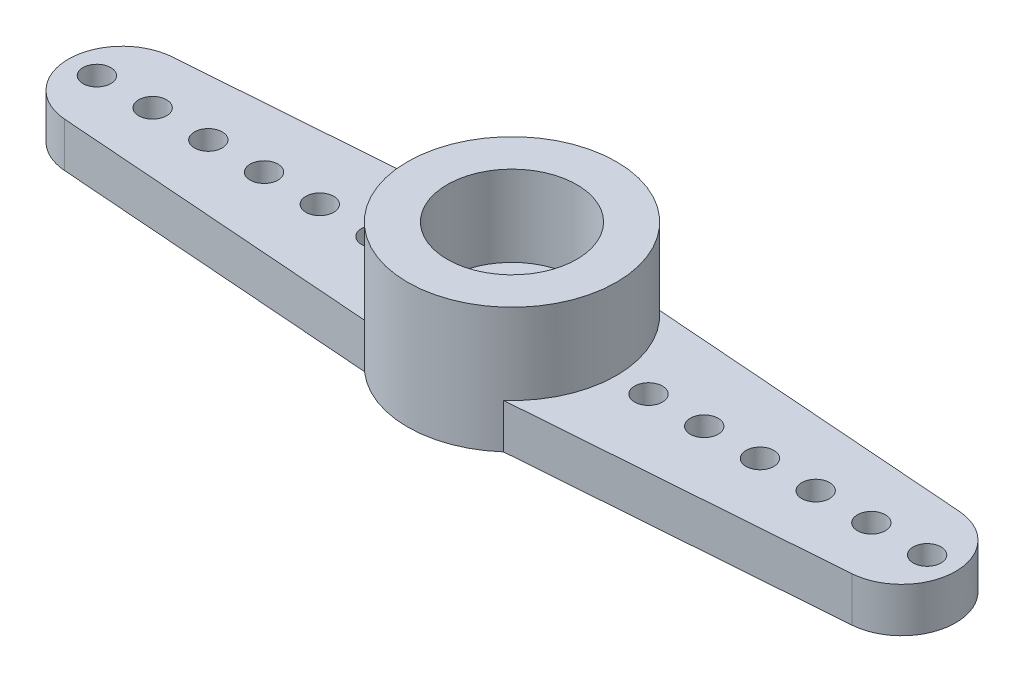
ISO-10303-21;
HEADER;
FILE_DESCRIPTION(('STEP AP214'),'2;1');
FILE_NAME('part.step','',(''),(''),'','','');
FILE_SCHEMA(('AUTOMOTIVE_DESIGN { 1 0 10303 214 1 1 1 1 }'));
ENDSEC;
DATA;
#1=APPLICATION_CONTEXT('core data for automotive mechanical design processes');
#2=APPLICATION_PROTOCOL_DEFINITION('international standard','automotive_design',2000,#1);
#3=PRODUCT_CONTEXT('',#1,'mechanical');
#4=PRODUCT('Part','Part','',(#3));
#5=PRODUCT_RELATED_PRODUCT_CATEGORY('part','',(#4));
#6=PRODUCT_DEFINITION_FORMATION('','',#4);
#7=PRODUCT_DEFINITION_CONTEXT('part definition',#1,'design');
#8=PRODUCT_DEFINITION('design','',#6,#7);
#9=PRODUCT_DEFINITION_SHAPE('','',#8);
#10=(LENGTH_UNIT() NAMED_UNIT(*) SI_UNIT(.MILLI.,.METRE.));
#11=(NAMED_UNIT(*) PLANE_ANGLE_UNIT() SI_UNIT($,.RADIAN.));
#12=(NAMED_UNIT(*) SI_UNIT($,.STERADIAN.) SOLID_ANGLE_UNIT());
#13=UNCERTAINTY_MEASURE_WITH_UNIT(LENGTH_MEASURE(1.E-05),#10,'distance_accuracy_value','');
#14=(GEOMETRIC_REPRESENTATION_CONTEXT(3) GLOBAL_UNCERTAINTY_ASSIGNED_CONTEXT((#13)) GLOBAL_UNIT_ASSIGNED_CONTEXT((#10,
#11,#12)) REPRESENTATION_CONTEXT('',''));
#15=CARTESIAN_POINT('',(0.,0.,0.));
#16=DIRECTION('',(0.,0.,1.));
#17=DIRECTION('',(1.,0.,0.));
#18=AXIS2_PLACEMENT_3D('',#15,#16,#17);
#19=CARTESIAN_POINT('',(0.,1.6,0.));
#20=DIRECTION('',(0.,-1.,0.));
#21=DIRECTION('',(0.,0.,-1.));
#22=AXIS2_PLACEMENT_3D('',#19,#20,#21);
#23=CYLINDRICAL_SURFACE('',#22,1.5);
#24=CARTESIAN_POINT('',(0.,1.6,0.));
#25=DIRECTION('',(0.,1.,0.));
#26=DIRECTION('',(0.,0.,1.));
#27=AXIS2_PLACEMENT_3D('',#24,#25,#26);
#28=CIRCLE('',#27,1.5);
#29=CARTESIAN_POINT('',(0.,1.6,1.5));
#30=VERTEX_POINT('',#29);
#31=EDGE_CURVE('E133',#30,#30,#28,.T.);
#32=ORIENTED_EDGE('',*,*,#31,.T.);
#33=EDGE_LOOP('',(#32));
#34=FACE_BOUND('',#33,.T.);
#35=CARTESIAN_POINT('',(0.,0.8,0.));
#36=DIRECTION('',(0.,-1.,0.));
#37=DIRECTION('',(0.,0.,-1.));
#38=AXIS2_PLACEMENT_3D('',#35,#36,#37);
#39=CIRCLE('',#38,1.5);
#40=CARTESIAN_POINT('',(0.,0.8,-1.5));
#41=VERTEX_POINT('',#40);
#42=EDGE_CURVE('E39',#41,#41,#39,.T.);
#43=ORIENTED_EDGE('',*,*,#42,.T.);
#44=EDGE_LOOP('',(#43));
#45=FACE_BOUND('',#44,.T.);
#46=ADVANCED_FACE('F32',(#34,#45),#23,.F.);
#47=CARTESIAN_POINT('',(14.1314068018781,1.76,-1.93230912585367));
#48=CARTESIAN_POINT('',(14.1314068018781,1.70666666666667,-1.93230912585367));
#49=CARTESIAN_POINT('',(14.1314068018781,1.65333333333333,-1.93230912585367));
#50=CARTESIAN_POINT('',(14.1314068018781,1.06666666666671,-1.93230912585367));
#51=CARTESIAN_POINT('',(14.1314068018781,0.53333333333331,-1.93230912585367));
#52=CARTESIAN_POINT('',(14.1314068018781,-0.0533333333333311,-1.93230912585367));
#53=CARTESIAN_POINT('',(14.1314068018781,-0.106666666666667,-1.93230912585367));
#54=CARTESIAN_POINT('',(14.1314068018781,-0.16,-1.93230912585367));
#55=CARTESIAN_POINT('',(17.4863916285294,1.76,-1.68214916068935));
#56=CARTESIAN_POINT('',(17.4863916285294,1.70666666666667,-1.68214916068935));
#57=CARTESIAN_POINT('',(17.4863916285294,1.65333333333332,-1.68214916068935));
#58=CARTESIAN_POINT('',(17.4863916285294,1.06666666666677,-1.68214916068935));
#59=CARTESIAN_POINT('',(17.4863916285294,0.53333333333331,-1.68214916068935));
#60=CARTESIAN_POINT('',(17.4863916285294,-0.0533333333333311,-1.68214916068935));
#61=CARTESIAN_POINT('',(17.4863916285294,-0.106666666666667,-1.68214916068935));
#62=CARTESIAN_POINT('',(17.4863916285294,-0.16,-1.68214916068935));
#63=CARTESIAN_POINT('',(17.4863916285294,1.76,1.68214916068935));
#64=CARTESIAN_POINT('',(17.4863916285294,1.7066666666667,1.68214916068935));
#65=CARTESIAN_POINT('',(17.4863916285294,1.65333333333329,1.68214916068935));
#66=CARTESIAN_POINT('',(17.4863916285294,1.06666666666706,1.68214916068935));
#67=CARTESIAN_POINT('',(17.4863916285294,0.53333333333331,1.68214916068935));
#68=CARTESIAN_POINT('',(17.4863916285294,-0.0533333333333311,1.68214916068935));
#69=CARTESIAN_POINT('',(17.4863916285294,-0.106666666666667,1.68214916068935));
#70=CARTESIAN_POINT('',(17.4863916285294,-0.16,1.68214916068935));
#71=CARTESIAN_POINT('',(14.1314068018781,1.76,1.93230912585367));
#72=CARTESIAN_POINT('',(14.1314068018781,1.7066666666667,1.93230912585367));
#73=CARTESIAN_POINT('',(14.1314068018781,1.65333333333329,1.93230912585367));
#74=CARTESIAN_POINT('',(14.1314068018781,1.06666666666712,1.93230912585367));
#75=CARTESIAN_POINT('',(14.1314068018781,0.53333333333331,1.93230912585367));
#76=CARTESIAN_POINT('',(14.1314068018781,-0.0533333333333311,1.93230912585367));
#77=CARTESIAN_POINT('',(14.1314068018781,-0.106666666666667,1.93230912585367));
#78=CARTESIAN_POINT('',(14.1314068018781,-0.16,1.93230912585367));
#79=(BOUNDED_SURFACE() B_SPLINE_SURFACE(3,3,((#47,#48,#49,#50,#51,#52,#53,#54),(#55,#56,#57,#58,
#59,#60,#61,#62),(#63,#64,#65,#66,#67,#68,#69,#70),(#71,#72,#73,#74,#75,#76,#77,#78)),
.UNSPECIFIED.,.F.,.F.,.F.) B_SPLINE_SURFACE_WITH_KNOTS((4,4),(4,2,2,4),(0.,1.),(-0.1,0.,1.,1.1),
.UNSPECIFIED.) GEOMETRIC_REPRESENTATION_ITEM() RATIONAL_B_SPLINE_SURFACE(((1.,1.,1.,1.,1.,1.,1.,
1.),(0.382904832106128,0.382904832106128,0.382904832106128,0.382904832106128,0.382904832106128,
0.382904832106128,0.382904832106128,0.382904832106128),(0.382904832106128,0.382904832106128,
0.382904832106128,0.382904832106128,0.382904832106128,0.382904832106128,0.382904832106128,
0.382904832106128),(1.,1.,1.,1.,1.,1.,1.,1.))) REPRESENTATION_ITEM('') SURFACE());
#80=CARTESIAN_POINT('',(14.1314068018781,-0.16,-1.93230912585367));
#81=CARTESIAN_POINT('',(14.1314068018781,-0.106666666666667,-1.93230912585367));
#82=CARTESIAN_POINT('',(14.1314068018781,-0.0533333333333311,-1.93230912585367));
#83=CARTESIAN_POINT('',(14.1314068018781,0.53333333333331,-1.93230912585367));
#84=CARTESIAN_POINT('',(14.1314068018781,1.06666666666671,-1.93230912585367));
#85=CARTESIAN_POINT('',(14.1314068018781,1.65333333333333,-1.93230912585367));
#86=CARTESIAN_POINT('',(14.1314068018781,1.70666666666667,-1.93230912585367));
#87=CARTESIAN_POINT('',(14.1314068018781,1.76,-1.93230912585367));
#88=(BOUNDED_CURVE() B_SPLINE_CURVE(3,(#80,#81,#82,#83,#84,#85,#86,#87),.UNSPECIFIED.,.F.,
.F.) B_SPLINE_CURVE_WITH_KNOTS((4,2,2,4),(-0.1,0.,1.,1.1),
.UNSPECIFIED.) CURVE() GEOMETRIC_REPRESENTATION_ITEM() RATIONAL_B_SPLINE_CURVE((1.,1.,1.,1.,1.,
1.,1.,1.)) REPRESENTATION_ITEM(''));
#89=CARTESIAN_POINT('',(14.1314068018781,1.6,-1.93230912585367));
#90=VERTEX_POINT('',#89);
#91=CARTESIAN_POINT('',(14.1314068018781,0.,-1.93230912585367));
#92=VERTEX_POINT('',#91);
#93=EDGE_CURVE('E272',#90,#92,#88,.F.);
#94=CARTESIAN_POINT('',(14.1314068018781,1.6,-1.93230912585367));
#95=CARTESIAN_POINT('',(17.4863916285294,1.6,-1.68214916068935));
#96=CARTESIAN_POINT('',(17.4863916285294,1.6,1.68214916068935));
#97=CARTESIAN_POINT('',(14.1314068018781,1.6,1.93230912585367));
#98=(BOUNDED_CURVE() B_SPLINE_CURVE(3,(#94,#95,#96,#97),.UNSPECIFIED.,.F.,
.F.) B_SPLINE_CURVE_WITH_KNOTS((4,4),(0.,1.),
.UNSPECIFIED.) CURVE() GEOMETRIC_REPRESENTATION_ITEM() RATIONAL_B_SPLINE_CURVE((1.,
0.382904832106128,0.382904832106128,1.)) REPRESENTATION_ITEM(''));
#99=CARTESIAN_POINT('',(14.1314068018781,1.6,1.93230912585367));
#100=VERTEX_POINT('',#99);
#101=EDGE_CURVE('E44',#100,#90,#98,.F.);
#102=CARTESIAN_POINT('',(14.1314068018781,1.76,1.93230912585367));
#103=CARTESIAN_POINT('',(14.1314068018781,1.7066666666667,1.93230912585367));
#104=CARTESIAN_POINT('',(14.1314068018781,1.65333333333329,1.93230912585367));
#105=CARTESIAN_POINT('',(14.1314068018781,1.06666666666712,1.93230912585367));
#106=CARTESIAN_POINT('',(14.1314068018781,0.53333333333331,1.93230912585367));
#107=CARTESIAN_POINT('',(14.1314068018781,-0.0533333333333311,1.93230912585367));
#108=CARTESIAN_POINT('',(14.1314068018781,-0.106666666666667,1.93230912585367));
#109=CARTESIAN_POINT('',(14.1314068018781,-0.16,1.93230912585367));
#110=(BOUNDED_CURVE() B_SPLINE_CURVE(3,(#102,#103,#104,#105,#106,#107,#108,#109),.UNSPECIFIED.,
.F.,.F.) B_SPLINE_CURVE_WITH_KNOTS((4,2,2,4),(-0.1,0.,1.,1.1),
.UNSPECIFIED.) CURVE() GEOMETRIC_REPRESENTATION_ITEM() RATIONAL_B_SPLINE_CURVE((1.,1.,1.,1.,1.,
1.,1.,1.)) REPRESENTATION_ITEM(''));
#111=CARTESIAN_POINT('',(14.1314068018781,0.,1.93230912585367));
#112=VERTEX_POINT('',#111);
#113=EDGE_CURVE('E106',#112,#100,#110,.F.);
#114=CARTESIAN_POINT('',(14.1314068018781,0.,1.93230912585367));
#115=CARTESIAN_POINT('',(17.4863916285294,0.,1.68214916068935));
#116=CARTESIAN_POINT('',(17.4863916285294,0.,-1.68214916068935));
#117=CARTESIAN_POINT('',(14.1314068018781,0.,-1.93230912585367));
#118=(BOUNDED_CURVE() B_SPLINE_CURVE(3,(#114,#115,#116,#117),.UNSPECIFIED.,.F.,
.F.) B_SPLINE_CURVE_WITH_KNOTS((4,4),(0.,1.),
.UNSPECIFIED.) CURVE() GEOMETRIC_REPRESENTATION_ITEM() RATIONAL_B_SPLINE_CURVE((1.,
0.382904832106128,0.382904832106128,1.)) REPRESENTATION_ITEM(''));
#119=EDGE_CURVE('E11',#92,#112,#118,.F.);
#120=ORIENTED_EDGE('',*,*,#93,.F.);
#121=ORIENTED_EDGE('',*,*,#101,.F.);
#122=ORIENTED_EDGE('',*,*,#113,.F.);
#123=ORIENTED_EDGE('',*,*,#119,.F.);
#124=EDGE_LOOP('',(#120,#121,#122,#123));
#125=FACE_BOUND('',#124,.T.);
#126=ADVANCED_FACE('F34',(#125),#79,.T.);
#127=CARTESIAN_POINT('',(-14.1314068018781,1.76,1.93230912585367));
#128=CARTESIAN_POINT('',(-14.1314068018781,1.7066666666667,1.93230912585367));
#129=CARTESIAN_POINT('',(-14.1314068018781,1.65333333333329,1.93230912585367));
#130=CARTESIAN_POINT('',(-14.1314068018781,1.06666666666712,1.93230912585367));
#131=CARTESIAN_POINT('',(-14.1314068018781,0.53333333333331,1.93230912585367));
#132=CARTESIAN_POINT('',(-14.1314068018781,-0.0533333333333311,1.93230912585367));
#133=CARTESIAN_POINT('',(-14.1314068018781,-0.106666666666667,1.93230912585367));
#134=CARTESIAN_POINT('',(-14.1314068018781,-0.16,1.93230912585367));
#135=CARTESIAN_POINT('',(-17.4863916285294,1.76,1.68214916068935));
#136=CARTESIAN_POINT('',(-17.4863916285294,1.7066666666667,1.68214916068935));
#137=CARTESIAN_POINT('',(-17.4863916285294,1.65333333333329,1.68214916068935));
#138=CARTESIAN_POINT('',(-17.4863916285294,1.06666666666712,1.68214916068935));
#139=CARTESIAN_POINT('',(-17.4863916285294,0.53333333333331,1.68214916068935));
#140=CARTESIAN_POINT('',(-17.4863916285294,-0.0533333333333311,1.68214916068935));
#141=CARTESIAN_POINT('',(-17.4863916285294,-0.106666666666667,1.68214916068935));
#142=CARTESIAN_POINT('',(-17.4863916285294,-0.16,1.68214916068935));
#143=CARTESIAN_POINT('',(-17.4863916285294,1.76,-1.68214916068935));
#144=CARTESIAN_POINT('',(-17.4863916285294,1.70666666666667,-1.68214916068935));
#145=CARTESIAN_POINT('',(-17.4863916285294,1.65333333333333,-1.68214916068935));
#146=CARTESIAN_POINT('',(-17.4863916285294,1.06666666666665,-1.68214916068935));
#147=CARTESIAN_POINT('',(-17.4863916285294,0.53333333333331,-1.68214916068935));
#148=CARTESIAN_POINT('',(-17.4863916285294,-0.0533333333333311,-1.68214916068935));
#149=CARTESIAN_POINT('',(-17.4863916285294,-0.106666666666667,-1.68214916068935));
#150=CARTESIAN_POINT('',(-17.4863916285294,-0.16,-1.68214916068935));
#151=CARTESIAN_POINT('',(-14.1314068018781,1.76,-1.93230912585367));
#152=CARTESIAN_POINT('',(-14.1314068018781,1.70666666666667,-1.93230912585367));
#153=CARTESIAN_POINT('',(-14.1314068018781,1.65333333333333,-1.93230912585367));
#154=CARTESIAN_POINT('',(-14.1314068018781,1.06666666666671,-1.93230912585367));
#155=CARTESIAN_POINT('',(-14.1314068018781,0.53333333333331,-1.93230912585367));
#156=CARTESIAN_POINT('',(-14.1314068018781,-0.0533333333333311,-1.93230912585367));
#157=CARTESIAN_POINT('',(-14.1314068018781,-0.106666666666667,-1.93230912585367));
#158=CARTESIAN_POINT('',(-14.1314068018781,-0.16,-1.93230912585367));
#159=(BOUNDED_SURFACE() B_SPLINE_SURFACE(3,3,((#127,#128,#129,#130,#131,#132,#133,#134),(#135,
#136,#137,#138,#139,#140,#141,#142),(#143,#144,#145,#146,#147,#148,#149,#150),(#151,#152,#153,
#154,#155,#156,#157,#158)),.UNSPECIFIED.,.F.,.F.,.F.) B_SPLINE_SURFACE_WITH_KNOTS((4,4),(4,2,2,
4),(0.,1.),(-0.1,0.,1.,1.1),
.UNSPECIFIED.) GEOMETRIC_REPRESENTATION_ITEM() RATIONAL_B_SPLINE_SURFACE(((1.,1.,1.,1.,1.,1.,1.,
1.),(0.382904832106128,0.382904832106128,0.382904832106128,0.382904832106128,0.382904832106128,
0.382904832106128,0.382904832106128,0.382904832106128),(0.382904832106128,0.382904832106128,
0.382904832106128,0.382904832106128,0.382904832106128,0.382904832106128,0.382904832106128,
0.382904832106128),(1.,1.,1.,1.,1.,1.,1.,1.))) REPRESENTATION_ITEM('') SURFACE());
#160=CARTESIAN_POINT('',(-14.1314068018781,1.76,-1.93230912585367));
#161=CARTESIAN_POINT('',(-14.1314068018781,1.70666666666667,-1.93230912585367));
#162=CARTESIAN_POINT('',(-14.1314068018781,1.65333333333333,-1.93230912585367));
#163=CARTESIAN_POINT('',(-14.1314068018781,1.06666666666671,-1.93230912585367));
#164=CARTESIAN_POINT('',(-14.1314068018781,0.53333333333331,-1.93230912585367));
#165=CARTESIAN_POINT('',(-14.1314068018781,-0.0533333333333311,-1.93230912585367));
#166=CARTESIAN_POINT('',(-14.1314068018781,-0.106666666666667,-1.93230912585367));
#167=CARTESIAN_POINT('',(-14.1314068018781,-0.16,-1.93230912585367));
#168=(BOUNDED_CURVE() B_SPLINE_CURVE(3,(#160,#161,#162,#163,#164,#165,#166,#167),.UNSPECIFIED.,
.F.,.F.) B_SPLINE_CURVE_WITH_KNOTS((4,2,2,4),(-0.1,0.,1.,1.1),
.UNSPECIFIED.) CURVE() GEOMETRIC_REPRESENTATION_ITEM() RATIONAL_B_SPLINE_CURVE((1.,1.,1.,1.,1.,
1.,1.,1.)) REPRESENTATION_ITEM(''));
#169=CARTESIAN_POINT('',(-14.1314068018781,0.,-1.93230912585367));
#170=VERTEX_POINT('',#169);
#171=CARTESIAN_POINT('',(-14.1314068018781,1.6,-1.93230912585367));
#172=VERTEX_POINT('',#171);
#173=EDGE_CURVE('E153',#170,#172,#168,.F.);
#174=CARTESIAN_POINT('',(-14.1314068018781,0.,-1.93230912585367));
#175=CARTESIAN_POINT('',(-17.4863916285294,0.,-1.68214916068935));
#176=CARTESIAN_POINT('',(-17.4863916285294,0.,1.68214916068935));
#177=CARTESIAN_POINT('',(-14.1314068018781,0.,1.93230912585367));
#178=(BOUNDED_CURVE() B_SPLINE_CURVE(3,(#174,#175,#176,#177),.UNSPECIFIED.,.F.,
.F.) B_SPLINE_CURVE_WITH_KNOTS((4,4),(0.,1.),
.UNSPECIFIED.) CURVE() GEOMETRIC_REPRESENTATION_ITEM() RATIONAL_B_SPLINE_CURVE((1.,
0.382904832106128,0.382904832106128,1.)) REPRESENTATION_ITEM(''));
#179=CARTESIAN_POINT('',(-14.1314068018781,0.,1.93230912585367));
#180=VERTEX_POINT('',#179);
#181=EDGE_CURVE('E482',#180,#170,#178,.F.);
#182=CARTESIAN_POINT('',(-14.1314068018781,-0.16,1.93230912585367));
#183=CARTESIAN_POINT('',(-14.1314068018781,-0.106666666666667,1.93230912585367));
#184=CARTESIAN_POINT('',(-14.1314068018781,-0.0533333333333311,1.93230912585367));
#185=CARTESIAN_POINT('',(-14.1314068018781,0.53333333333331,1.93230912585367));
#186=CARTESIAN_POINT('',(-14.1314068018781,1.06666666666712,1.93230912585367));
#187=CARTESIAN_POINT('',(-14.1314068018781,1.65333333333329,1.93230912585367));
#188=CARTESIAN_POINT('',(-14.1314068018781,1.7066666666667,1.93230912585367));
#189=CARTESIAN_POINT('',(-14.1314068018781,1.76,1.93230912585367));
#190=(BOUNDED_CURVE() B_SPLINE_CURVE(3,(#182,#183,#184,#185,#186,#187,#188,#189),.UNSPECIFIED.,
.F.,.F.) B_SPLINE_CURVE_WITH_KNOTS((4,2,2,4),(-0.1,0.,1.,1.1),
.UNSPECIFIED.) CURVE() GEOMETRIC_REPRESENTATION_ITEM() RATIONAL_B_SPLINE_CURVE((1.,1.,1.,1.,1.,
1.,1.,1.)) REPRESENTATION_ITEM(''));
#191=CARTESIAN_POINT('',(-14.1314068018781,1.6,1.93230912585367));
#192=VERTEX_POINT('',#191);
#193=EDGE_CURVE('E171',#192,#180,#190,.F.);
#194=CARTESIAN_POINT('',(-14.1314068018781,1.6,1.93230912585367));
#195=CARTESIAN_POINT('',(-17.4863916285294,1.6,1.68214916068935));
#196=CARTESIAN_POINT('',(-17.4863916285294,1.6,-1.68214916068935));
#197=CARTESIAN_POINT('',(-14.1314068018781,1.6,-1.93230912585367));
#198=(BOUNDED_CURVE() B_SPLINE_CURVE(3,(#194,#195,#196,#197),.UNSPECIFIED.,.F.,
.F.) B_SPLINE_CURVE_WITH_KNOTS((4,4),(0.,1.),
.UNSPECIFIED.) CURVE() GEOMETRIC_REPRESENTATION_ITEM() RATIONAL_B_SPLINE_CURVE((1.,
0.382904832106128,0.382904832106128,1.)) REPRESENTATION_ITEM(''));
#199=EDGE_CURVE('E305',#172,#192,#198,.F.);
#200=ORIENTED_EDGE('',*,*,#173,.F.);
#201=ORIENTED_EDGE('',*,*,#181,.F.);
#202=ORIENTED_EDGE('',*,*,#193,.F.);
#203=ORIENTED_EDGE('',*,*,#199,.F.);
#204=EDGE_LOOP('',(#200,#201,#202,#203));
#205=FACE_BOUND('',#204,.T.);
#206=ADVANCED_FACE('F194',(#205),#159,.T.);
#207=CARTESIAN_POINT('',(0.,1.6,0.));
#208=DIRECTION('',(0.,1.,0.));
#209=DIRECTION('',(0.,0.,1.));
#210=AXIS2_PLACEMENT_3D('',#207,#208,#209);
#211=PLANE('',#210);
#212=DIRECTION('',(0.997231667992043,0.,-0.0743572481591926));
#213=VECTOR('',#212,1.);
#214=CARTESIAN_POINT('',(2.49449393665328,1.6,2.8));
#215=LINE('',#214,#213);
#216=CARTESIAN_POINT('',(2.49449393665328,1.6,2.8));
#217=VERTEX_POINT('',#216);
#218=EDGE_CURVE('E101',#217,#100,#215,.T.);
#219=ORIENTED_EDGE('',*,*,#218,.T.);
#220=ORIENTED_EDGE('',*,*,#101,.T.);
#221=DIRECTION('',(-0.997231667992043,0.,-0.0743572481591926));
#222=VECTOR('',#221,1.);
#223=CARTESIAN_POINT('',(2.49449393665328,1.6,-2.8));
#224=LINE('',#223,#222);
#225=CARTESIAN_POINT('',(2.49449393665328,1.6,-2.8));
#226=VERTEX_POINT('',#225);
#227=EDGE_CURVE('E110',#90,#226,#224,.T.);
#228=ORIENTED_EDGE('',*,*,#227,.T.);
#229=CARTESIAN_POINT('',(0.,1.6,0.));
#230=DIRECTION('',(0.,1.,0.));
#231=DIRECTION('',(0.,0.,1.));
#232=AXIS2_PLACEMENT_3D('',#229,#230,#231);
#233=CIRCLE('',#232,3.75);
#234=EDGE_CURVE('E118',#217,#226,#233,.T.);
#235=ORIENTED_EDGE('',*,*,#234,.F.);
#236=EDGE_LOOP('',(#219,#220,#228,#235));
#237=FACE_BOUND('',#236,.T.);
#238=CARTESIAN_POINT('',(12.9,1.6,0.));
#239=DIRECTION('',(0.,1.,0.));
#240=DIRECTION('',(0.,0.,1.));
#241=AXIS2_PLACEMENT_3D('',#238,#239,#240);
#242=CIRCLE('',#241,0.500000000000001);
#243=CARTESIAN_POINT('',(12.9,1.6,0.500000000000001));
#244=VERTEX_POINT('',#243);
#245=EDGE_CURVE('E347',#244,#244,#242,.T.);
#246=ORIENTED_EDGE('',*,*,#245,.F.);
#247=EDGE_LOOP('',(#246));
#248=FACE_BOUND('',#247,.T.);
#249=CARTESIAN_POINT('',(8.9,1.6,0.));
#250=DIRECTION('',(0.,1.,0.));
#251=DIRECTION('',(0.,0.,1.));
#252=AXIS2_PLACEMENT_3D('',#249,#250,#251);
#253=CIRCLE('',#252,0.500000000000001);
#254=CARTESIAN_POINT('',(8.9,1.6,0.500000000000001));
#255=VERTEX_POINT('',#254);
#256=EDGE_CURVE('E335',#255,#255,#253,.T.);
#257=ORIENTED_EDGE('',*,*,#256,.F.);
#258=EDGE_LOOP('',(#257));
#259=FACE_BOUND('',#258,.T.);
#260=CARTESIAN_POINT('',(4.9,1.6,0.));
#261=DIRECTION('',(0.,1.,0.));
#262=DIRECTION('',(0.,0.,1.));
#263=AXIS2_PLACEMENT_3D('',#260,#261,#262);
#264=CIRCLE('',#263,0.500000000000001);
#265=CARTESIAN_POINT('',(4.9,1.6,0.500000000000001));
#266=VERTEX_POINT('',#265);
#267=EDGE_CURVE('E323',#266,#266,#264,.T.);
#268=ORIENTED_EDGE('',*,*,#267,.F.);
#269=EDGE_LOOP('',(#268));
#270=FACE_BOUND('',#269,.T.);
#271=CARTESIAN_POINT('',(6.9,1.6,0.));
#272=DIRECTION('',(0.,1.,0.));
#273=DIRECTION('',(0.,0.,1.));
#274=AXIS2_PLACEMENT_3D('',#271,#272,#273);
#275=CIRCLE('',#274,0.500000000000001);
#276=CARTESIAN_POINT('',(6.9,1.6,0.500000000000001));
#277=VERTEX_POINT('',#276);
#278=EDGE_CURVE('E330',#277,#277,#275,.T.);
#279=ORIENTED_EDGE('',*,*,#278,.F.);
#280=EDGE_LOOP('',(#279));
#281=FACE_BOUND('',#280,.T.);
#282=CARTESIAN_POINT('',(10.9,1.6,0.));
#283=DIRECTION('',(0.,1.,0.));
#284=DIRECTION('',(0.,0.,1.));
#285=AXIS2_PLACEMENT_3D('',#282,#283,#284);
#286=CIRCLE('',#285,0.500000000000001);
#287=CARTESIAN_POINT('',(10.9,1.6,0.500000000000001));
#288=VERTEX_POINT('',#287);
#289=EDGE_CURVE('E341',#288,#288,#286,.T.);
#290=ORIENTED_EDGE('',*,*,#289,.F.);
#291=EDGE_LOOP('',(#290));
#292=FACE_BOUND('',#291,.T.);
#293=CARTESIAN_POINT('',(14.9,1.6,0.));
#294=DIRECTION('',(0.,1.,0.));
#295=DIRECTION('',(0.,0.,1.));
#296=AXIS2_PLACEMENT_3D('',#293,#294,#295);
#297=CIRCLE('',#296,0.500000000000001);
#298=CARTESIAN_POINT('',(14.9,1.6,0.500000000000001));
#299=VERTEX_POINT('',#298);
#300=EDGE_CURVE('E353',#299,#299,#297,.T.);
#301=ORIENTED_EDGE('',*,*,#300,.F.);
#302=EDGE_LOOP('',(#301));
#303=FACE_BOUND('',#302,.T.);
#304=ADVANCED_FACE('F125',(#237,#248,#259,#270,#281,#292,#303),#211,.T.);
#305=ORIENTED_EDGE('',*,*,#31,.F.);
#306=EDGE_LOOP('',(#305));
#307=FACE_BOUND('',#306,.T.);
#308=CARTESIAN_POINT('',(0.,1.6,0.));
#309=DIRECTION('',(0.,1.,0.));
#310=DIRECTION('',(0.,0.,1.));
#311=AXIS2_PLACEMENT_3D('',#308,#309,#310);
#312=CIRCLE('',#311,2.325);
#313=CARTESIAN_POINT('',(0.,1.6,2.325));
#314=VERTEX_POINT('',#313);
#315=EDGE_CURVE('E136',#314,#314,#312,.T.);
#316=ORIENTED_EDGE('',*,*,#315,.T.);
#317=EDGE_LOOP('',(#316));
#318=FACE_BOUND('',#317,.T.);
#319=ADVANCED_FACE('F402',(#307,#318),#211,.T.);
#320=DIRECTION('',(-0.997231667992043,0.,0.0743572481591926));
#321=VECTOR('',#320,1.);
#322=CARTESIAN_POINT('',(-2.49449393665328,1.6,-2.8));
#323=LINE('',#322,#321);
#324=CARTESIAN_POINT('',(-2.49449393665328,1.6,-2.8));
#325=VERTEX_POINT('',#324);
#326=EDGE_CURVE('E162',#325,#172,#323,.T.);
#327=ORIENTED_EDGE('',*,*,#326,.T.);
#328=ORIENTED_EDGE('',*,*,#199,.T.);
#329=DIRECTION('',(0.997231667992043,0.,0.0743572481591926));
#330=VECTOR('',#329,1.);
#331=CARTESIAN_POINT('',(-2.49449393665328,1.6,2.8));
#332=LINE('',#331,#330);
#333=CARTESIAN_POINT('',(-2.49449393665328,1.6,2.8));
#334=VERTEX_POINT('',#333);
#335=EDGE_CURVE('E111',#192,#334,#332,.T.);
#336=ORIENTED_EDGE('',*,*,#335,.T.);
#337=EDGE_CURVE('E149',#325,#334,#233,.T.);
#338=ORIENTED_EDGE('',*,*,#337,.F.);
#339=EDGE_LOOP('',(#327,#328,#336,#338));
#340=FACE_BOUND('',#339,.T.);
#341=CARTESIAN_POINT('',(-4.9,1.6,0.));
#342=DIRECTION('',(0.,1.,0.));
#343=DIRECTION('',(0.,0.,-1.));
#344=AXIS2_PLACEMENT_3D('',#341,#342,#343);
#345=CIRCLE('',#344,0.500000000000001);
#346=CARTESIAN_POINT('',(-4.9,1.6,-0.500000000000001));
#347=VERTEX_POINT('',#346);
#348=EDGE_CURVE('E389',#347,#347,#345,.T.);
#349=ORIENTED_EDGE('',*,*,#348,.F.);
#350=EDGE_LOOP('',(#349));
#351=FACE_BOUND('',#350,.T.);
#352=CARTESIAN_POINT('',(-8.9,1.6,0.));
#353=DIRECTION('',(0.,1.,0.));
#354=DIRECTION('',(0.,0.,-1.));
#355=AXIS2_PLACEMENT_3D('',#352,#353,#354);
#356=CIRCLE('',#355,0.500000000000001);
#357=CARTESIAN_POINT('',(-8.9,1.6,-0.500000000000001));
#358=VERTEX_POINT('',#357);
#359=EDGE_CURVE('E377',#358,#358,#356,.T.);
#360=ORIENTED_EDGE('',*,*,#359,.F.);
#361=EDGE_LOOP('',(#360));
#362=FACE_BOUND('',#361,.T.);
#363=CARTESIAN_POINT('',(-12.9,1.6,0.));
#364=DIRECTION('',(0.,1.,0.));
#365=DIRECTION('',(0.,0.,-1.));
#366=AXIS2_PLACEMENT_3D('',#363,#364,#365);
#367=CIRCLE('',#366,0.500000000000001);
#368=CARTESIAN_POINT('',(-12.9,1.6,-0.500000000000001));
#369=VERTEX_POINT('',#368);
#370=EDGE_CURVE('E365',#369,#369,#367,.T.);
#371=ORIENTED_EDGE('',*,*,#370,.F.);
#372=EDGE_LOOP('',(#371));
#373=FACE_BOUND('',#372,.T.);
#374=CARTESIAN_POINT('',(-14.9,1.6,0.));
#375=DIRECTION('',(0.,1.,0.));
#376=DIRECTION('',(0.,0.,-1.));
#377=AXIS2_PLACEMENT_3D('',#374,#375,#376);
#378=CIRCLE('',#377,0.500000000000001);
#379=CARTESIAN_POINT('',(-14.9,1.6,-0.500000000000001));
#380=VERTEX_POINT('',#379);
#381=EDGE_CURVE('E359',#380,#380,#378,.T.);
#382=ORIENTED_EDGE('',*,*,#381,.F.);
#383=EDGE_LOOP('',(#382));
#384=FACE_BOUND('',#383,.T.);
#385=CARTESIAN_POINT('',(-10.9,1.6,0.));
#386=DIRECTION('',(0.,1.,0.));
#387=DIRECTION('',(0.,0.,-1.));
#388=AXIS2_PLACEMENT_3D('',#385,#386,#387);
#389=CIRCLE('',#388,0.500000000000001);
#390=CARTESIAN_POINT('',(-10.9,1.6,-0.500000000000001));
#391=VERTEX_POINT('',#390);
#392=EDGE_CURVE('E371',#391,#391,#389,.T.);
#393=ORIENTED_EDGE('',*,*,#392,.F.);
#394=EDGE_LOOP('',(#393));
#395=FACE_BOUND('',#394,.T.);
#396=CARTESIAN_POINT('',(-6.9,1.6,0.));
#397=DIRECTION('',(0.,1.,0.));
#398=DIRECTION('',(0.,0.,-1.));
#399=AXIS2_PLACEMENT_3D('',#396,#397,#398);
#400=CIRCLE('',#399,0.500000000000001);
#401=CARTESIAN_POINT('',(-6.9,1.6,-0.500000000000001));
#402=VERTEX_POINT('',#401);
#403=EDGE_CURVE('E383',#402,#402,#400,.T.);
#404=ORIENTED_EDGE('',*,*,#403,.F.);
#405=EDGE_LOOP('',(#404));
#406=FACE_BOUND('',#405,.T.);
#407=ADVANCED_FACE('F253',(#340,#351,#362,#373,#384,#395,#406),#211,.T.);
#408=CARTESIAN_POINT('',(0.,0.,0.));
#409=DIRECTION('',(0.,1.,0.));
#410=DIRECTION('',(0.,0.,1.));
#411=AXIS2_PLACEMENT_3D('',#408,#409,#410);
#412=PLANE('',#411);
#413=CARTESIAN_POINT('',(0.,0.,0.));
#414=DIRECTION('',(0.,-1.,0.));
#415=DIRECTION('',(0.,0.,-1.));
#416=AXIS2_PLACEMENT_3D('',#413,#414,#415);
#417=CIRCLE('',#416,2.45);
#418=CARTESIAN_POINT('',(0.,0.,-2.45));
#419=VERTEX_POINT('',#418);
#420=EDGE_CURVE('E461',#419,#419,#417,.T.);
#421=ORIENTED_EDGE('',*,*,#420,.F.);
#422=EDGE_LOOP('',(#421));
#423=FACE_BOUND('',#422,.T.);
#424=CARTESIAN_POINT('',(-4.9,0.,0.));
#425=DIRECTION('',(0.,1.,0.));
#426=DIRECTION('',(0.,0.,-1.));
#427=AXIS2_PLACEMENT_3D('',#424,#425,#426);
#428=CIRCLE('',#427,0.500000000000001);
#429=CARTESIAN_POINT('',(-4.9,0.,-0.500000000000001));
#430=VERTEX_POINT('',#429);
#431=EDGE_CURVE('E392',#430,#430,#428,.T.);
#432=ORIENTED_EDGE('',*,*,#431,.T.);
#433=EDGE_LOOP('',(#432));
#434=FACE_BOUND('',#433,.T.);
#435=CARTESIAN_POINT('',(-8.9,0.,0.));
#436=DIRECTION('',(0.,1.,0.));
#437=DIRECTION('',(0.,0.,-1.));
#438=AXIS2_PLACEMENT_3D('',#435,#436,#437);
#439=CIRCLE('',#438,0.500000000000001);
#440=CARTESIAN_POINT('',(-8.9,0.,-0.500000000000001));
#441=VERTEX_POINT('',#440);
#442=EDGE_CURVE('E380',#441,#441,#439,.T.);
#443=ORIENTED_EDGE('',*,*,#442,.T.);
#444=EDGE_LOOP('',(#443));
#445=FACE_BOUND('',#444,.T.);
#446=CARTESIAN_POINT('',(-12.9,0.,0.));
#447=DIRECTION('',(0.,1.,0.));
#448=DIRECTION('',(0.,0.,-1.));
#449=AXIS2_PLACEMENT_3D('',#446,#447,#448);
#450=CIRCLE('',#449,0.500000000000001);
#451=CARTESIAN_POINT('',(-12.9,0.,-0.500000000000001));
#452=VERTEX_POINT('',#451);
#453=EDGE_CURVE('E368',#452,#452,#450,.T.);
#454=ORIENTED_EDGE('',*,*,#453,.T.);
#455=EDGE_LOOP('',(#454));
#456=FACE_BOUND('',#455,.T.);
#457=CARTESIAN_POINT('',(14.9,0.,0.));
#458=DIRECTION('',(0.,1.,0.));
#459=DIRECTION('',(0.,0.,1.));
#460=AXIS2_PLACEMENT_3D('',#457,#458,#459);
#461=CIRCLE('',#460,0.500000000000001);
#462=CARTESIAN_POINT('',(14.9,0.,0.500000000000001));
#463=VERTEX_POINT('',#462);
#464=EDGE_CURVE('E356',#463,#463,#461,.T.);
#465=ORIENTED_EDGE('',*,*,#464,.T.);
#466=EDGE_LOOP('',(#465));
#467=FACE_BOUND('',#466,.T.);
#468=CARTESIAN_POINT('',(10.9,0.,0.));
#469=DIRECTION('',(0.,1.,0.));
#470=DIRECTION('',(0.,0.,1.));
#471=AXIS2_PLACEMENT_3D('',#468,#469,#470);
#472=CIRCLE('',#471,0.500000000000001);
#473=CARTESIAN_POINT('',(10.9,0.,0.500000000000001));
#474=VERTEX_POINT('',#473);
#475=EDGE_CURVE('E344',#474,#474,#472,.T.);
#476=ORIENTED_EDGE('',*,*,#475,.T.);
#477=EDGE_LOOP('',(#476));
#478=FACE_BOUND('',#477,.T.);
#479=CARTESIAN_POINT('',(6.9,0.,0.));
#480=DIRECTION('',(0.,1.,0.));
#481=DIRECTION('',(0.,0.,1.));
#482=AXIS2_PLACEMENT_3D('',#479,#480,#481);
#483=CIRCLE('',#482,0.500000000000001);
#484=CARTESIAN_POINT('',(6.9,0.,0.500000000000001));
#485=VERTEX_POINT('',#484);
#486=EDGE_CURVE('E332',#485,#485,#483,.T.);
#487=ORIENTED_EDGE('',*,*,#486,.T.);
#488=EDGE_LOOP('',(#487));
#489=FACE_BOUND('',#488,.T.);
#490=DIRECTION('',(-0.997231667992043,0.,-0.0743572481591926));
#491=VECTOR('',#490,1.);
#492=CARTESIAN_POINT('',(2.49449393665328,0.,-2.8));
#493=LINE('',#492,#491);
#494=CARTESIAN_POINT('',(2.49449393665328,0.,-2.8));
#495=VERTEX_POINT('',#494);
#496=EDGE_CURVE('E227',#92,#495,#493,.T.);
#497=ORIENTED_EDGE('',*,*,#496,.F.);
#498=ORIENTED_EDGE('',*,*,#119,.T.);
#499=DIRECTION('',(0.997231667992043,0.,-0.0743572481591926));
#500=VECTOR('',#499,1.);
#501=CARTESIAN_POINT('',(2.49449393665328,0.,2.8));
#502=LINE('',#501,#500);
#503=CARTESIAN_POINT('',(2.49449393665328,0.,2.8));
#504=VERTEX_POINT('',#503);
#505=EDGE_CURVE('E223',#504,#112,#502,.T.);
#506=ORIENTED_EDGE('',*,*,#505,.F.);
#507=CARTESIAN_POINT('',(0.,0.,0.));
#508=DIRECTION('',(0.,1.,0.));
#509=DIRECTION('',(0.,0.,1.));
#510=AXIS2_PLACEMENT_3D('',#507,#508,#509);
#511=CIRCLE('',#510,3.75);
#512=CARTESIAN_POINT('',(-2.49449393665328,0.,2.8));
#513=VERTEX_POINT('',#512);
#514=EDGE_CURVE('E121',#513,#504,#511,.T.);
#515=ORIENTED_EDGE('',*,*,#514,.F.);
#516=DIRECTION('',(0.997231667992043,0.,0.0743572481591926));
#517=VECTOR('',#516,1.);
#518=CARTESIAN_POINT('',(-2.49449393665328,0.,2.8));
#519=LINE('',#518,#517);
#520=EDGE_CURVE('E163',#180,#513,#519,.T.);
#521=ORIENTED_EDGE('',*,*,#520,.F.);
#522=ORIENTED_EDGE('',*,*,#181,.T.);
#523=DIRECTION('',(-0.997231667992043,0.,0.0743572481591926));
#524=VECTOR('',#523,1.);
#525=CARTESIAN_POINT('',(-2.49449393665328,0.,-2.8));
#526=LINE('',#525,#524);
#527=CARTESIAN_POINT('',(-2.49449393665328,0.,-2.8));
#528=VERTEX_POINT('',#527);
#529=EDGE_CURVE('E212',#528,#170,#526,.T.);
#530=ORIENTED_EDGE('',*,*,#529,.F.);
#531=CARTESIAN_POINT('',(0.,0.,0.));
#532=DIRECTION('',(0.,1.,0.));
#533=DIRECTION('',(0.,0.,1.));
#534=AXIS2_PLACEMENT_3D('',#531,#532,#533);
#535=CIRCLE('',#534,3.75);
#536=EDGE_CURVE('E215',#495,#528,#535,.T.);
#537=ORIENTED_EDGE('',*,*,#536,.F.);
#538=EDGE_LOOP('',(#497,#498,#506,#515,#521,#522,#530,#537));
#539=FACE_BOUND('',#538,.T.);
#540=CARTESIAN_POINT('',(4.9,0.,0.));
#541=DIRECTION('',(0.,1.,0.));
#542=DIRECTION('',(0.,0.,1.));
#543=AXIS2_PLACEMENT_3D('',#540,#541,#542);
#544=CIRCLE('',#543,0.500000000000001);
#545=CARTESIAN_POINT('',(4.9,0.,0.500000000000001));
#546=VERTEX_POINT('',#545);
#547=EDGE_CURVE('E325',#546,#546,#544,.T.);
#548=ORIENTED_EDGE('',*,*,#547,.T.);
#549=EDGE_LOOP('',(#548));
#550=FACE_BOUND('',#549,.T.);
#551=CARTESIAN_POINT('',(8.9,0.,0.));
#552=DIRECTION('',(0.,1.,0.));
#553=DIRECTION('',(0.,0.,1.));
#554=AXIS2_PLACEMENT_3D('',#551,#552,#553);
#555=CIRCLE('',#554,0.500000000000001);
#556=CARTESIAN_POINT('',(8.9,0.,0.500000000000001));
#557=VERTEX_POINT('',#556);
#558=EDGE_CURVE('E338',#557,#557,#555,.T.);
#559=ORIENTED_EDGE('',*,*,#558,.T.);
#560=EDGE_LOOP('',(#559));
#561=FACE_BOUND('',#560,.T.);
#562=CARTESIAN_POINT('',(12.9,0.,0.));
#563=DIRECTION('',(0.,1.,0.));
#564=DIRECTION('',(0.,0.,1.));
#565=AXIS2_PLACEMENT_3D('',#562,#563,#564);
#566=CIRCLE('',#565,0.500000000000001);
#567=CARTESIAN_POINT('',(12.9,0.,0.500000000000001));
#568=VERTEX_POINT('',#567);
#569=EDGE_CURVE('E350',#568,#568,#566,.T.);
#570=ORIENTED_EDGE('',*,*,#569,.T.);
#571=EDGE_LOOP('',(#570));
#572=FACE_BOUND('',#571,.T.);
#573=CARTESIAN_POINT('',(-14.9,0.,0.));
#574=DIRECTION('',(0.,1.,0.));
#575=DIRECTION('',(0.,0.,-1.));
#576=AXIS2_PLACEMENT_3D('',#573,#574,#575);
#577=CIRCLE('',#576,0.500000000000001);
#578=CARTESIAN_POINT('',(-14.9,0.,-0.500000000000001));
#579=VERTEX_POINT('',#578);
#580=EDGE_CURVE('E362',#579,#579,#577,.T.);
#581=ORIENTED_EDGE('',*,*,#580,.T.);
#582=EDGE_LOOP('',(#581));
#583=FACE_BOUND('',#582,.T.);
#584=CARTESIAN_POINT('',(-10.9,0.,0.));
#585=DIRECTION('',(0.,1.,0.));
#586=DIRECTION('',(0.,0.,-1.));
#587=AXIS2_PLACEMENT_3D('',#584,#585,#586);
#588=CIRCLE('',#587,0.500000000000001);
#589=CARTESIAN_POINT('',(-10.9,0.,-0.500000000000001));
#590=VERTEX_POINT('',#589);
#591=EDGE_CURVE('E374',#590,#590,#588,.T.);
#592=ORIENTED_EDGE('',*,*,#591,.T.);
#593=EDGE_LOOP('',(#592));
#594=FACE_BOUND('',#593,.T.);
#595=CARTESIAN_POINT('',(-6.9,0.,0.));
#596=DIRECTION('',(0.,1.,0.));
#597=DIRECTION('',(0.,0.,-1.));
#598=AXIS2_PLACEMENT_3D('',#595,#596,#597);
#599=CIRCLE('',#598,0.500000000000001);
#600=CARTESIAN_POINT('',(-6.9,0.,-0.500000000000001));
#601=VERTEX_POINT('',#600);
#602=EDGE_CURVE('E386',#601,#601,#599,.T.);
#603=ORIENTED_EDGE('',*,*,#602,.T.);
#604=EDGE_LOOP('',(#603));
#605=FACE_BOUND('',#604,.T.);
#606=ADVANCED_FACE('F192',(#423,#434,#445,#456,#467,#478,#489,#539,#550,#561,#572,#583,#594,
#605),#412,.F.);
#607=CARTESIAN_POINT('',(-2.49449393665328,1.6,-2.8));
#608=DIRECTION('',(0.0743572481591926,0.,0.997231667992043));
#609=DIRECTION('',(0.997231667992043,0.,-0.0743572481591926));
#610=AXIS2_PLACEMENT_3D('',#607,#608,#609);
#611=PLANE('',#610);
#612=ORIENTED_EDGE('',*,*,#529,.T.);
#613=ORIENTED_EDGE('',*,*,#173,.T.);
#614=ORIENTED_EDGE('',*,*,#326,.F.);
#615=DIRECTION('',(0.,-1.,0.));
#616=VECTOR('',#615,1.);
#617=CARTESIAN_POINT('',(-2.49449393665328,1.6,-2.8));
#618=LINE('',#617,#616);
#619=EDGE_CURVE('E154',#325,#528,#618,.T.);
#620=ORIENTED_EDGE('',*,*,#619,.T.);
#621=EDGE_LOOP('',(#612,#613,#614,#620));
#622=FACE_BOUND('',#621,.T.);
#623=ADVANCED_FACE('F188',(#622),#611,.F.);
#624=CARTESIAN_POINT('',(-2.49449393665328,1.6,2.8));
#625=DIRECTION('',(0.0743572481591926,0.,-0.997231667992043));
#626=DIRECTION('',(-0.997231667992043,0.,-0.0743572481591926));
#627=AXIS2_PLACEMENT_3D('',#624,#625,#626);
#628=PLANE('',#627);
#629=ORIENTED_EDGE('',*,*,#335,.F.);
#630=ORIENTED_EDGE('',*,*,#193,.T.);
#631=ORIENTED_EDGE('',*,*,#520,.T.);
#632=DIRECTION('',(0.,-1.,0.));
#633=VECTOR('',#632,1.);
#634=CARTESIAN_POINT('',(-2.49449393665328,1.6,2.8));
#635=LINE('',#634,#633);
#636=EDGE_CURVE('E122',#334,#513,#635,.T.);
#637=ORIENTED_EDGE('',*,*,#636,.F.);
#638=EDGE_LOOP('',(#629,#630,#631,#637));
#639=FACE_BOUND('',#638,.T.);
#640=ADVANCED_FACE('F178',(#639),#628,.F.);
#641=CARTESIAN_POINT('',(0.,1.6,0.));
#642=DIRECTION('',(0.,-1.,0.));
#643=DIRECTION('',(0.,0.,-1.));
#644=AXIS2_PLACEMENT_3D('',#641,#642,#643);
#645=CYLINDRICAL_SURFACE('',#644,3.75);
#646=ORIENTED_EDGE('',*,*,#514,.T.);
#647=DIRECTION('',(0.,-1.,0.));
#648=VECTOR('',#647,1.);
#649=CARTESIAN_POINT('',(2.49449393665328,1.6,2.8));
#650=LINE('',#649,#648);
#651=EDGE_CURVE('E105',#217,#504,#650,.T.);
#652=ORIENTED_EDGE('',*,*,#651,.F.);
#653=ORIENTED_EDGE('',*,*,#234,.T.);
#654=DIRECTION('',(0.,-1.,0.));
#655=VECTOR('',#654,1.);
#656=CARTESIAN_POINT('',(2.49449393665328,1.6,-2.8));
#657=LINE('',#656,#655);
#658=EDGE_CURVE('E123',#226,#495,#657,.T.);
#659=ORIENTED_EDGE('',*,*,#658,.T.);
#660=ORIENTED_EDGE('',*,*,#536,.T.);
#661=ORIENTED_EDGE('',*,*,#619,.F.);
#662=ORIENTED_EDGE('',*,*,#337,.T.);
#663=ORIENTED_EDGE('',*,*,#636,.T.);
#664=EDGE_LOOP('',(#646,#652,#653,#659,#660,#661,#662,#663));
#665=FACE_BOUND('',#664,.T.);
#666=CARTESIAN_POINT('',(0.,4.5,0.));
#667=DIRECTION('',(0.,1.,0.));
#668=DIRECTION('',(0.,0.,1.));
#669=AXIS2_PLACEMENT_3D('',#666,#667,#668);
#670=CIRCLE('',#669,3.75);
#671=CARTESIAN_POINT('',(0.,4.5,3.75));
#672=VERTEX_POINT('',#671);
#673=EDGE_CURVE('E129',#672,#672,#670,.T.);
#674=ORIENTED_EDGE('',*,*,#673,.F.);
#675=EDGE_LOOP('',(#674));
#676=FACE_BOUND('',#675,.T.);
#677=ADVANCED_FACE('F115',(#665,#676),#645,.T.);
#678=CARTESIAN_POINT('',(2.49449393665328,1.6,2.8));
#679=DIRECTION('',(-0.0743572481591926,0.,-0.997231667992043));
#680=DIRECTION('',(-0.997231667992043,0.,0.0743572481591926));
#681=AXIS2_PLACEMENT_3D('',#678,#679,#680);
#682=PLANE('',#681);
#683=ORIENTED_EDGE('',*,*,#505,.T.);
#684=ORIENTED_EDGE('',*,*,#113,.T.);
#685=ORIENTED_EDGE('',*,*,#218,.F.);
#686=ORIENTED_EDGE('',*,*,#651,.T.);
#687=EDGE_LOOP('',(#683,#684,#685,#686));
#688=FACE_BOUND('',#687,.T.);
#689=ADVANCED_FACE('F104',(#688),#682,.F.);
#690=CARTESIAN_POINT('',(2.49449393665328,1.6,-2.8));
#691=DIRECTION('',(-0.0743572481591926,0.,0.997231667992043));
#692=DIRECTION('',(0.997231667992043,0.,0.0743572481591926));
#693=AXIS2_PLACEMENT_3D('',#690,#691,#692);
#694=PLANE('',#693);
#695=ORIENTED_EDGE('',*,*,#227,.F.);
#696=ORIENTED_EDGE('',*,*,#93,.T.);
#697=ORIENTED_EDGE('',*,*,#496,.T.);
#698=ORIENTED_EDGE('',*,*,#658,.F.);
#699=EDGE_LOOP('',(#695,#696,#697,#698));
#700=FACE_BOUND('',#699,.T.);
#701=ADVANCED_FACE('F244',(#700),#694,.F.);
#702=CARTESIAN_POINT('',(4.9,1.6,0.));
#703=DIRECTION('',(0.,-1.,0.));
#704=DIRECTION('',(0.,0.,-1.));
#705=AXIS2_PLACEMENT_3D('',#702,#703,#704);
#706=CYLINDRICAL_SURFACE('',#705,0.500000000000001);
#707=ORIENTED_EDGE('',*,*,#267,.T.);
#708=EDGE_LOOP('',(#707));
#709=FACE_BOUND('',#708,.T.);
#710=ORIENTED_EDGE('',*,*,#547,.F.);
#711=EDGE_LOOP('',(#710));
#712=FACE_BOUND('',#711,.T.);
#713=ADVANCED_FACE('F248',(#709,#712),#706,.F.);
#714=CARTESIAN_POINT('',(6.9,1.6,0.));
#715=DIRECTION('',(0.,-1.,0.));
#716=DIRECTION('',(0.,0.,-1.));
#717=AXIS2_PLACEMENT_3D('',#714,#715,#716);
#718=CYLINDRICAL_SURFACE('',#717,0.500000000000001);
#719=ORIENTED_EDGE('',*,*,#278,.T.);
#720=EDGE_LOOP('',(#719));
#721=FACE_BOUND('',#720,.T.);
#722=ORIENTED_EDGE('',*,*,#486,.F.);
#723=EDGE_LOOP('',(#722));
#724=FACE_BOUND('',#723,.T.);
#725=ADVANCED_FACE('F697',(#721,#724),#718,.F.);
#726=CARTESIAN_POINT('',(8.9,1.6,0.));
#727=DIRECTION('',(0.,-1.,0.));
#728=DIRECTION('',(0.,0.,-1.));
#729=AXIS2_PLACEMENT_3D('',#726,#727,#728);
#730=CYLINDRICAL_SURFACE('',#729,0.500000000000001);
#731=ORIENTED_EDGE('',*,*,#256,.T.);
#732=EDGE_LOOP('',(#731));
#733=FACE_BOUND('',#732,.T.);
#734=ORIENTED_EDGE('',*,*,#558,.F.);
#735=EDGE_LOOP('',(#734));
#736=FACE_BOUND('',#735,.T.);
#737=ADVANCED_FACE('F687',(#733,#736),#730,.F.);
#738=CARTESIAN_POINT('',(10.9,1.6,0.));
#739=DIRECTION('',(0.,-1.,0.));
#740=DIRECTION('',(0.,0.,-1.));
#741=AXIS2_PLACEMENT_3D('',#738,#739,#740);
#742=CYLINDRICAL_SURFACE('',#741,0.500000000000001);
#743=ORIENTED_EDGE('',*,*,#289,.T.);
#744=EDGE_LOOP('',(#743));
#745=FACE_BOUND('',#744,.T.);
#746=ORIENTED_EDGE('',*,*,#475,.F.);
#747=EDGE_LOOP('',(#746));
#748=FACE_BOUND('',#747,.T.);
#749=ADVANCED_FACE('F677',(#745,#748),#742,.F.);
#750=CARTESIAN_POINT('',(12.9,1.6,0.));
#751=DIRECTION('',(0.,-1.,0.));
#752=DIRECTION('',(0.,0.,-1.));
#753=AXIS2_PLACEMENT_3D('',#750,#751,#752);
#754=CYLINDRICAL_SURFACE('',#753,0.500000000000001);
#755=ORIENTED_EDGE('',*,*,#245,.T.);
#756=EDGE_LOOP('',(#755));
#757=FACE_BOUND('',#756,.T.);
#758=ORIENTED_EDGE('',*,*,#569,.F.);
#759=EDGE_LOOP('',(#758));
#760=FACE_BOUND('',#759,.T.);
#761=ADVANCED_FACE('F667',(#757,#760),#754,.F.);
#762=CARTESIAN_POINT('',(14.9,1.6,0.));
#763=DIRECTION('',(0.,-1.,0.));
#764=DIRECTION('',(0.,0.,-1.));
#765=AXIS2_PLACEMENT_3D('',#762,#763,#764);
#766=CYLINDRICAL_SURFACE('',#765,0.500000000000001);
#767=ORIENTED_EDGE('',*,*,#300,.T.);
#768=EDGE_LOOP('',(#767));
#769=FACE_BOUND('',#768,.T.);
#770=ORIENTED_EDGE('',*,*,#464,.F.);
#771=EDGE_LOOP('',(#770));
#772=FACE_BOUND('',#771,.T.);
#773=ADVANCED_FACE('F657',(#769,#772),#766,.F.);
#774=CARTESIAN_POINT('',(-14.9,1.6,0.));
#775=DIRECTION('',(0.,-1.,0.));
#776=DIRECTION('',(0.,0.,-1.));
#777=AXIS2_PLACEMENT_3D('',#774,#775,#776);
#778=CYLINDRICAL_SURFACE('',#777,0.500000000000001);
#779=ORIENTED_EDGE('',*,*,#381,.T.);
#780=EDGE_LOOP('',(#779));
#781=FACE_BOUND('',#780,.T.);
#782=ORIENTED_EDGE('',*,*,#580,.F.);
#783=EDGE_LOOP('',(#782));
#784=FACE_BOUND('',#783,.T.);
#785=ADVANCED_FACE('F647',(#781,#784),#778,.F.);
#786=CARTESIAN_POINT('',(-12.9,1.6,0.));
#787=DIRECTION('',(0.,-1.,0.));
#788=DIRECTION('',(0.,0.,-1.));
#789=AXIS2_PLACEMENT_3D('',#786,#787,#788);
#790=CYLINDRICAL_SURFACE('',#789,0.500000000000001);
#791=ORIENTED_EDGE('',*,*,#370,.T.);
#792=EDGE_LOOP('',(#791));
#793=FACE_BOUND('',#792,.T.);
#794=ORIENTED_EDGE('',*,*,#453,.F.);
#795=EDGE_LOOP('',(#794));
#796=FACE_BOUND('',#795,.T.);
#797=ADVANCED_FACE('F637',(#793,#796),#790,.F.);
#798=CARTESIAN_POINT('',(-10.9,1.6,0.));
#799=DIRECTION('',(0.,-1.,0.));
#800=DIRECTION('',(0.,0.,-1.));
#801=AXIS2_PLACEMENT_3D('',#798,#799,#800);
#802=CYLINDRICAL_SURFACE('',#801,0.500000000000001);
#803=ORIENTED_EDGE('',*,*,#392,.T.);
#804=EDGE_LOOP('',(#803));
#805=FACE_BOUND('',#804,.T.);
#806=ORIENTED_EDGE('',*,*,#591,.F.);
#807=EDGE_LOOP('',(#806));
#808=FACE_BOUND('',#807,.T.);
#809=ADVANCED_FACE('F427',(#805,#808),#802,.F.);
#810=CARTESIAN_POINT('',(-8.9,1.6,0.));
#811=DIRECTION('',(0.,-1.,0.));
#812=DIRECTION('',(0.,0.,-1.));
#813=AXIS2_PLACEMENT_3D('',#810,#811,#812);
#814=CYLINDRICAL_SURFACE('',#813,0.500000000000001);
#815=ORIENTED_EDGE('',*,*,#359,.T.);
#816=EDGE_LOOP('',(#815));
#817=FACE_BOUND('',#816,.T.);
#818=ORIENTED_EDGE('',*,*,#442,.F.);
#819=EDGE_LOOP('',(#818));
#820=FACE_BOUND('',#819,.T.);
#821=ADVANCED_FACE('F417',(#817,#820),#814,.F.);
#822=CARTESIAN_POINT('',(-6.9,1.6,0.));
#823=DIRECTION('',(0.,-1.,0.));
#824=DIRECTION('',(0.,0.,-1.));
#825=AXIS2_PLACEMENT_3D('',#822,#823,#824);
#826=CYLINDRICAL_SURFACE('',#825,0.500000000000001);
#827=ORIENTED_EDGE('',*,*,#403,.T.);
#828=EDGE_LOOP('',(#827));
#829=FACE_BOUND('',#828,.T.);
#830=ORIENTED_EDGE('',*,*,#602,.F.);
#831=EDGE_LOOP('',(#830));
#832=FACE_BOUND('',#831,.T.);
#833=ADVANCED_FACE('F414',(#829,#832),#826,.F.);
#834=CARTESIAN_POINT('',(-4.9,1.6,0.));
#835=DIRECTION('',(0.,-1.,0.));
#836=DIRECTION('',(0.,0.,-1.));
#837=AXIS2_PLACEMENT_3D('',#834,#835,#836);
#838=CYLINDRICAL_SURFACE('',#837,0.500000000000001);
#839=ORIENTED_EDGE('',*,*,#348,.T.);
#840=EDGE_LOOP('',(#839));
#841=FACE_BOUND('',#840,.T.);
#842=ORIENTED_EDGE('',*,*,#431,.F.);
#843=EDGE_LOOP('',(#842));
#844=FACE_BOUND('',#843,.T.);
#845=ADVANCED_FACE('F397',(#841,#844),#838,.F.);
#846=CARTESIAN_POINT('',(0.,4.5,0.));
#847=DIRECTION('',(0.,1.,0.));
#848=DIRECTION('',(0.,0.,1.));
#849=AXIS2_PLACEMENT_3D('',#846,#847,#848);
#850=PLANE('',#849);
#851=ORIENTED_EDGE('',*,*,#673,.T.);
#852=EDGE_LOOP('',(#851));
#853=FACE_BOUND('',#852,.T.);
#854=CARTESIAN_POINT('',(0.,4.5,0.));
#855=DIRECTION('',(0.,1.,0.));
#856=DIRECTION('',(0.,0.,1.));
#857=AXIS2_PLACEMENT_3D('',#854,#855,#856);
#858=CIRCLE('',#857,2.325);
#859=CARTESIAN_POINT('',(0.,4.5,2.325));
#860=VERTEX_POINT('',#859);
#861=EDGE_CURVE('E130',#860,#860,#858,.T.);
#862=ORIENTED_EDGE('',*,*,#861,.F.);
#863=EDGE_LOOP('',(#862));
#864=FACE_BOUND('',#863,.T.);
#865=ADVANCED_FACE('F425',(#853,#864),#850,.T.);
#866=CARTESIAN_POINT('',(0.,4.5,0.));
#867=DIRECTION('',(0.,-1.,0.));
#868=DIRECTION('',(0.,0.,-1.));
#869=AXIS2_PLACEMENT_3D('',#866,#867,#868);
#870=CYLINDRICAL_SURFACE('',#869,2.325);
#871=ORIENTED_EDGE('',*,*,#861,.T.);
#872=EDGE_LOOP('',(#871));
#873=FACE_BOUND('',#872,.T.);
#874=ORIENTED_EDGE('',*,*,#315,.F.);
#875=EDGE_LOOP('',(#874));
#876=FACE_BOUND('',#875,.T.);
#877=ADVANCED_FACE('F441',(#873,#876),#870,.F.);
#878=CARTESIAN_POINT('',(0.,0.8,0.));
#879=DIRECTION('',(0.,-1.,0.));
#880=DIRECTION('',(0.,0.,-1.));
#881=AXIS2_PLACEMENT_3D('',#878,#879,#880);
#882=CYLINDRICAL_SURFACE('',#881,2.45);
#883=CARTESIAN_POINT('',(0.,0.8,0.));
#884=DIRECTION('',(0.,-1.,0.));
#885=DIRECTION('',(0.,0.,-1.));
#886=AXIS2_PLACEMENT_3D('',#883,#884,#885);
#887=CIRCLE('',#886,2.45);
#888=CARTESIAN_POINT('',(0.,0.8,-2.45));
#889=VERTEX_POINT('',#888);
#890=EDGE_CURVE('E460',#889,#889,#887,.T.);
#891=ORIENTED_EDGE('',*,*,#890,.F.);
#892=EDGE_LOOP('',(#891));
#893=FACE_BOUND('',#892,.T.);
#894=ORIENTED_EDGE('',*,*,#420,.T.);
#895=EDGE_LOOP('',(#894));
#896=FACE_BOUND('',#895,.T.);
#897=ADVANCED_FACE('F445',(#893,#896),#882,.F.);
#898=CARTESIAN_POINT('',(0.,0.8,0.));
#899=DIRECTION('',(0.,-1.,0.));
#900=DIRECTION('',(0.,0.,-1.));
#901=AXIS2_PLACEMENT_3D('',#898,#899,#900);
#902=PLANE('',#901);
#903=ORIENTED_EDGE('',*,*,#42,.F.);
#904=EDGE_LOOP('',(#903));
#905=FACE_BOUND('',#904,.T.);
#906=ORIENTED_EDGE('',*,*,#890,.T.);
#907=EDGE_LOOP('',(#906));
#908=FACE_BOUND('',#907,.T.);
#909=ADVANCED_FACE('F449',(#905,#908),#902,.T.);
#910=CLOSED_SHELL('',(#46,#126,#206,#304,#319,#407,#606,#623,#640,#677,#689,#701,#713,#725,#737,
#749,#761,#773,#785,#797,#809,#821,#833,#845,#865,#877,#897,#909));
#911=MANIFOLD_SOLID_BREP('B2',#910);
#912=ADVANCED_BREP_SHAPE_REPRESENTATION('',(#18,#911),#14);
#913=SHAPE_DEFINITION_REPRESENTATION(#9,#912);
ENDSEC;
END-ISO-10303-21;
